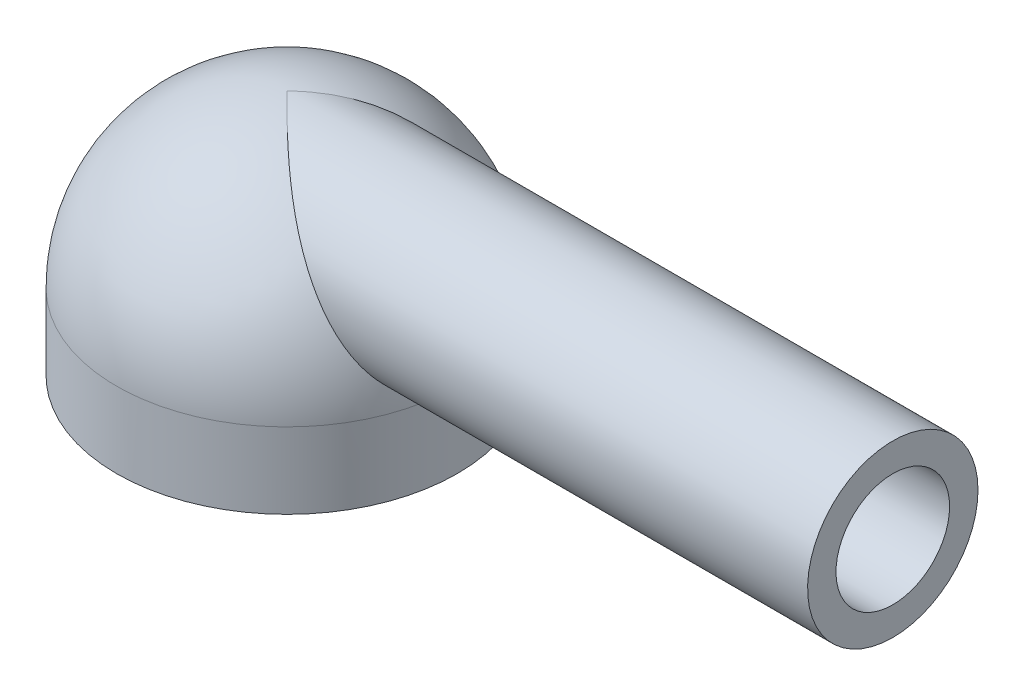
ISO-10303-21;
HEADER;
FILE_DESCRIPTION(('STEP AP214'),'2;1');
FILE_NAME('part.step','',(''),(''),'','','');
FILE_SCHEMA(('AUTOMOTIVE_DESIGN { 1 0 10303 214 1 1 1 1 }'));
ENDSEC;
DATA;
#1=APPLICATION_CONTEXT('core data for automotive mechanical design processes');
#2=APPLICATION_PROTOCOL_DEFINITION('international standard','automotive_design',2000,#1);
#3=PRODUCT_CONTEXT('',#1,'mechanical');
#4=PRODUCT('Part','Part','',(#3));
#5=PRODUCT_RELATED_PRODUCT_CATEGORY('part','',(#4));
#6=PRODUCT_DEFINITION_FORMATION('','',#4);
#7=PRODUCT_DEFINITION_CONTEXT('part definition',#1,'design');
#8=PRODUCT_DEFINITION('design','',#6,#7);
#9=PRODUCT_DEFINITION_SHAPE('','',#8);
#10=(LENGTH_UNIT() NAMED_UNIT(*) SI_UNIT(.MILLI.,.METRE.));
#11=(NAMED_UNIT(*) PLANE_ANGLE_UNIT() SI_UNIT($,.RADIAN.));
#12=(NAMED_UNIT(*) SI_UNIT($,.STERADIAN.) SOLID_ANGLE_UNIT());
#13=UNCERTAINTY_MEASURE_WITH_UNIT(LENGTH_MEASURE(1.E-05),#10,'distance_accuracy_value','');
#14=(GEOMETRIC_REPRESENTATION_CONTEXT(3) GLOBAL_UNCERTAINTY_ASSIGNED_CONTEXT((#13)) GLOBAL_UNIT_ASSIGNED_CONTEXT((#10,
#11,#12)) REPRESENTATION_CONTEXT('',''));
#15=CARTESIAN_POINT('',(0.,0.,0.));
#16=DIRECTION('',(0.,0.,1.));
#17=DIRECTION('',(1.,0.,0.));
#18=AXIS2_PLACEMENT_3D('',#15,#16,#17);
#19=CARTESIAN_POINT('',(0.,1.,0.));
#20=DIRECTION('',(0.,-1.,0.));
#21=DIRECTION('',(0.,0.,1.));
#22=AXIS2_PLACEMENT_3D('',#19,#20,#21);
#23=SPHERICAL_SURFACE('',#22,2.25);
#24=CARTESIAN_POINT('',(0.,3.25,0.));
#25=CARTESIAN_POINT('',(9.05811432640901E-10,3.25,1.96018961577093E-06));
#26=CARTESIAN_POINT('',(1.33427028641567E-07,3.2499999999936,3.92031702239373E-06));
#27=CARTESIAN_POINT('',(6.20651964426027E-07,3.24999999996991,7.81326036176809E-06));
#28=CARTESIAN_POINT('',(9.7564636450451E-07,3.24999999995261,9.74603717467581E-06));
#29=CARTESIAN_POINT('',(2.32527904397885E-06,3.24999999988665,1.55043494262035E-05));
#30=CARTESIAN_POINT('',(3.60356854436376E-06,3.24999999982398,1.9263289765096E-05));
#31=CARTESIAN_POINT('',(6.72941668249995E-06,3.24999999966975,2.66996610941845E-05));
#32=CARTESIAN_POINT('',(8.59752791974171E-06,3.24999999957715,3.03679582621604E-05));
#33=CARTESIAN_POINT('',(1.27272592921817E-05,3.24999999937084,3.74576214970043E-05));
#34=CARTESIAN_POINT('',(1.4987883583727E-05,3.24999999925719,4.08795821893033E-05));
#35=CARTESIAN_POINT('',(2.27908201300751E-05,3.24999999886121,5.17748336515401E-05));
#36=CARTESIAN_POINT('',(2.88549184995158E-05,3.24999999854796,5.88744167160316E-05));
#37=CARTESIAN_POINT('',(4.16969162792588E-05,3.24999999786524,7.21374830147851E-05));
#38=CARTESIAN_POINT('',(4.84621950668114E-05,3.24999999749673,7.83138492218285E-05));
#39=CARTESIAN_POINT('',(7.33235224988269E-05,3.2499999960966,0.000100045656462333));
#40=CARTESIAN_POINT('',(9.21583530649733E-05,3.24999999495096,0.000114724349133618));
#41=CARTESIAN_POINT('',(0.000129465223487893,3.24999999201135,0.000142094647758346));
#42=CARTESIAN_POINT('',(0.000147887228419324,3.24999999026202,0.000154853038861179));
#43=CARTESIAN_POINT('',(0.000259199743905247,3.24999997681058,0.000238884880226714));
#44=CARTESIAN_POINT('',(0.000336415153716784,3.24999995437168,0.000328752215362982));
#45=CARTESIAN_POINT('',(0.000613902739817747,3.24999984529659,0.000632994323338853));
#46=CARTESIAN_POINT('',(0.000825970468211919,3.24999971282642,0.000833192554454458));
#47=CARTESIAN_POINT('',(0.00156163805063496,3.24999904796458,0.00154355811611628));
#48=CARTESIAN_POINT('',(0.00207411316121067,3.24999821374081,0.00206709560574095));
#49=CARTESIAN_POINT('',(0.00395321699217932,3.24999386205143,0.0039718673965563));
#50=CARTESIAN_POINT('',(0.00533091849721474,3.24998818867695,0.00533978277079203));
#51=CARTESIAN_POINT('',(0.0301732512724062,3.24984048810671,0.0300216930954134));
#52=CARTESIAN_POINT('',(0.05352184286538,3.24897086247769,0.0534776793398877));
#53=CARTESIAN_POINT('',(0.0998239687153791,3.24580366264258,0.0997783083600828));
#54=CARTESIAN_POINT('',(0.12277656532948,3.24353357753292,0.122626090570724));
#55=CARTESIAN_POINT('',(0.170095404440222,3.23740604094128,0.169624312342776));
#56=CARTESIAN_POINT('',(0.194459186101241,3.23345722598542,0.193765687040525));
#57=CARTESIAN_POINT('',(0.243277039450825,3.22396210923072,0.241894621719224));
#58=CARTESIAN_POINT('',(0.267730924792469,3.21840763542557,0.26588073639537));
#59=CARTESIAN_POINT('',(0.333601920514515,3.20130078692018,0.330071059930498));
#60=CARTESIAN_POINT('',(0.37497366631697,3.18826515023657,0.369937856240129));
#61=CARTESIAN_POINT('',(0.456938826950228,3.15793971568935,0.447635047779458));
#62=CARTESIAN_POINT('',(0.497535240821788,3.140709290488,0.485485577814262));
#63=CARTESIAN_POINT('',(0.580803562405959,3.10088869079971,0.561435283913795));
#64=CARTESIAN_POINT('',(0.623458652430685,3.07804481395,0.599420562946998));
#65=CARTESIAN_POINT('',(0.70851988946529,3.02769589572361,0.672871247610606));
#66=CARTESIAN_POINT('',(0.750924497618804,3.00017365298055,0.708326642530363));
#67=CARTESIAN_POINT('',(0.836880032171281,2.93957732111965,0.777353211503859));
#68=CARTESIAN_POINT('',(0.880410982538738,2.90632828048585,0.810796575609238));
#69=CARTESIAN_POINT('',(0.96674570345769,2.83545220233582,0.873570066948758));
#70=CARTESIAN_POINT('',(1.00955018100497,2.79782973861746,0.902904421881505));
#71=CARTESIAN_POINT('',(1.13051149311976,2.68470924413531,0.979913587964727));
#72=CARTESIAN_POINT('',(1.20775529417918,2.60422452525122,1.02195313196816));
#73=CARTESIAN_POINT('',(1.35763817857081,2.43327703175708,1.08573337434004));
#74=CARTESIAN_POINT('',(1.43031809884676,2.34293187020593,1.10768916161262));
#75=CARTESIAN_POINT('',(1.55234430805659,2.18019066022006,1.12580512876139));
#76=CARTESIAN_POINT('',(1.60284730034388,2.10922890521001,1.12718484668288));
#77=CARTESIAN_POINT('',(1.70050978959545,1.96584485699836,1.11600502551307));
#78=CARTESIAN_POINT('',(1.74766368789531,1.8934203665487,1.10342270379711));
#79=CARTESIAN_POINT('',(1.83796360191609,1.74953008649378,1.06313933787959));
#80=CARTESIAN_POINT('',(1.88108209405442,1.67807337525351,1.03534223832011));
#81=CARTESIAN_POINT('',(1.96189507652379,1.54004361795748,0.964087054679175));
#82=CARTESIAN_POINT('',(1.99959582203502,1.47346498407589,0.920647237832456));
#83=CARTESIAN_POINT('',(2.06375235395952,1.35747327521119,0.825456803845492));
#84=CARTESIAN_POINT('',(2.09103883775237,1.30695604170453,0.775614695086924));
#85=CARTESIAN_POINT('',(2.13982862383019,1.21521296284135,0.665600100582713));
#86=CARTESIAN_POINT('',(2.16133833179745,1.17397683425307,0.605439179403784));
#87=CARTESIAN_POINT('',(2.19519938630672,1.10837551274702,0.485875736139792));
#88=CARTESIAN_POINT('',(2.20841631518883,1.08244813499091,0.427572297538004));
#89=CARTESIAN_POINT('',(2.22958801136468,1.04068910851535,0.306563131699245));
#90=CARTESIAN_POINT('',(2.23754660627152,1.024850116625,0.243860643449958));
#91=CARTESIAN_POINT('',(2.24743468831599,1.00513725027923,0.122309484891463));
#92=CARTESIAN_POINT('',(2.24986509190567,1.00026968111413,0.0636605517483716));
#93=CARTESIAN_POINT('',(2.25012384470635,0.999752448967473,-0.0536812432773582));
#94=CARTESIAN_POINT('',(2.24795345260052,1.00410026484589,-0.112374088755059));
#95=CARTESIAN_POINT('',(2.2392295454547,1.02149724790953,-0.226059552526846));
#96=CARTESIAN_POINT('',(2.23282683616555,1.03424699150812,-0.281110174927975));
#97=CARTESIAN_POINT('',(2.2159663837537,1.06758387392855,-0.388120255767393));
#98=CARTESIAN_POINT('',(2.20550846960751,1.08817134329655,-0.440079583727378));
#99=CARTESIAN_POINT('',(2.1804949319796,1.13693404100862,-0.540891203125296));
#100=CARTESIAN_POINT('',(2.16584439797177,1.16528426875943,-0.589634928271874));
#101=CARTESIAN_POINT('',(2.13290818909164,1.22821044217023,-0.681540949791084));
#102=CARTESIAN_POINT('',(2.11462163413809,1.26278789490852,-0.724701890695102));
#103=CARTESIAN_POINT('',(2.07331856787636,1.33969186391435,-0.807679610229763));
#104=CARTESIAN_POINT('',(2.05005297203464,1.38240142912751,-0.847016375188481));
#105=CARTESIAN_POINT('',(2.0002250192626,1.47209816991994,-0.917942160916231));
#106=CARTESIAN_POINT('',(1.97366132345519,1.51908708064057,-0.949528019584249));
#107=CARTESIAN_POINT('',(1.91457809647107,1.62126925479918,-1.00782439432713));
#108=CARTESIAN_POINT('',(1.88172480102675,1.67679550709773,-1.03361135364823));
#109=CARTESIAN_POINT('',(1.81303690601438,1.78959025458501,-1.07552323897644));
#110=CARTESIAN_POINT('',(1.77720140497117,1.84685927324261,-1.09164523124148));
#111=CARTESIAN_POINT('',(1.69805779361712,1.96927349668296,-1.1161408890697));
#112=CARTESIAN_POINT('',(1.65439056121297,2.03445021082627,-1.12319396350044));
#113=CARTESIAN_POINT('',(1.564371508806,2.1632321769573,-1.12619770629819));
#114=CARTESIAN_POINT('',(1.51801657173228,2.22683547714306,-1.12213522067329));
#115=CARTESIAN_POINT('',(1.41628409168364,2.35981464298391,-1.10255519822098));
#116=CARTESIAN_POINT('',(1.36056894147832,2.42870162829896,-1.08547134805787));
#117=CARTESIAN_POINT('',(1.24705462495726,2.56025378078396,-1.03972156373415));
#118=CARTESIAN_POINT('',(1.18926117386618,2.62293446152127,-1.01108546558183));
#119=CARTESIAN_POINT('',(1.06421668325056,2.74859803823612,-0.939489714525024));
#120=CARTESIAN_POINT('',(0.996718523000147,2.81054477633036,-0.895145064098794));
#121=CARTESIAN_POINT('',(0.859093961899253,2.92411318490263,-0.795503254234519));
#122=CARTESIAN_POINT('',(0.78894427851278,2.97558262839053,-0.740065060006015));
#123=CARTESIAN_POINT('',(0.677965969308491,3.04643868792741,-0.646826348610847));
#124=CARTESIAN_POINT('',(0.637525857807023,3.07009403154212,-0.611717227600246));
#125=CARTESIAN_POINT('',(0.556254824590361,3.11321434186365,-0.539290474954689));
#126=CARTESIAN_POINT('',(0.515423431414927,3.13267334054035,-0.501969792892079));
#127=CARTESIAN_POINT('',(0.435608786853856,3.16633599504905,-0.427581293261126));
#128=CARTESIAN_POINT('',(0.396637818381272,3.18075753280826,-0.390598165131041));
#129=CARTESIAN_POINT('',(0.318724228913849,3.205521842123,-0.315666999349266));
#130=CARTESIAN_POINT('',(0.279782490063122,3.21588517906847,-0.277724892096529));
#131=CARTESIAN_POINT('',(0.222923202689021,3.22805542501954,-0.22184955745478));
#132=CARTESIAN_POINT('',(0.205043460190169,3.23145639678119,-0.204210800295072));
#133=CARTESIAN_POINT('',(0.169013208388568,3.23745064343145,-0.168551318312389));
#134=CARTESIAN_POINT('',(0.150862474079695,3.24003170775099,-0.150528733594428));
#135=CARTESIAN_POINT('',(0.111152063662967,3.2447148452035,-0.111042972600443));
#136=CARTESIAN_POINT('',(0.0895871946271036,3.24663813263176,-0.0895642610960563));
#137=CARTESIAN_POINT('',(0.0476197553800065,3.24917859010716,-0.047580857989562));
#138=CARTESIAN_POINT('',(0.0272146701362946,3.24985807848282,-0.0270831441996352));
#139=CARTESIAN_POINT('',(0.00533347032050108,3.24998817350003,-0.00534225598084578));
#140=CARTESIAN_POINT('',(0.00395826622833466,3.24999384119597,-0.0039768746547119));
#141=CARTESIAN_POINT('',(0.0020800060472701,3.24999820365381,-0.00207296783718035));
#142=CARTESIAN_POINT('',(0.00156589904999307,3.24999904289415,-0.00154773843605029));
#143=CARTESIAN_POINT('',(0.000827913614110669,3.24999971149246,-0.000835166176924274));
#144=CARTESIAN_POINT('',(0.000615212431637305,3.24999984465491,-0.000634385111542994));
#145=CARTESIAN_POINT('',(0.000336981975193171,3.24999995422359,-0.00032929277820059));
#146=CARTESIAN_POINT('',(0.00025960565877801,3.2499999767482,-0.000239225217301168));
#147=CARTESIAN_POINT('',(0.00014804940548948,3.24999999024117,-0.000155049794049268));
#148=CARTESIAN_POINT('',(0.000129598684508558,3.24999999199459,-0.000142278539871497));
#149=CARTESIAN_POINT('',(9.22348729509783E-05,3.2499999949409,-0.000114874780399028));
#150=CARTESIAN_POINT('',(7.33721434150802E-05,3.24999999608896,-0.000100175020056816));
#151=CARTESIAN_POINT('',(4.84788619246233E-05,3.24999999749196,-7.84114748966533E-05));
#152=CARTESIAN_POINT('',(4.1706834563031E-05,3.24999999786114,-7.22274463632436E-05));
#153=CARTESIAN_POINT('',(2.88532179018688E-05,3.24999999854513,-5.89469620452586E-05));
#154=CARTESIAN_POINT('',(2.27842970472567E-05,3.24999999885898,-5.1837579092599E-05));
#155=CARTESIAN_POINT('',(1.49770124356685E-05,3.24999999925572,-4.09275495933417E-05));
#156=CARTESIAN_POINT('',(1.27155474001509E-05,3.24999999936958,-3.75012426503708E-05));
#157=CARTESIAN_POINT('',(8.58499386477057E-06,3.24999999957628,-3.04025878530365E-05));
#158=CARTESIAN_POINT('',(6.716904930263E-06,3.24999999966906,-2.67296437654157E-05));
#159=CARTESIAN_POINT('',(3.59231351423734E-06,3.24999999982359,-1.92841712109348E-05));
#160=CARTESIAN_POINT('',(2.31519247947946E-06,3.24999999988639,-1.5520791937995E-05));
#161=CARTESIAN_POINT('',(9.68428839193062E-07,3.24999999995249,-9.75602292873E-06));
#162=CARTESIAN_POINT('',(6.14571616704862E-07,3.24999999996983,-7.82114465495061E-06));
#163=CARTESIAN_POINT('',(1.3004990353239E-07,3.24999999999357,-3.92413076441127E-06));
#164=CARTESIAN_POINT('',(-9.06663831045385E-10,3.25,-1.96203421906304E-06));
#165=CARTESIAN_POINT('',(0.,3.25,0.));
#166=B_SPLINE_CURVE_WITH_KNOTS('',3,(#24,#25,#26,#27,#28,#29,#30,#31,#32,#33,#34,#35,#36,#37,
#38,#39,#40,#41,#42,#43,#44,#45,#46,#47,#48,#49,#50,#51,#52,#53,#54,#55,#56,#57,#58,#59,#60,#61,
#62,#63,#64,#65,#66,#67,#68,#69,#70,#71,#72,#73,#74,#75,#76,#77,#78,#79,#80,#81,#82,#83,#84,#85,
#86,#87,#88,#89,#90,#91,#92,#93,#94,#95,#96,#97,#98,#99,#100,#101,#102,#103,#104,#105,#106,#107,
#108,#109,#110,#111,#112,#113,#114,#115,#116,#117,#118,#119,#120,#121,#122,#123,#124,#125,#126,
#127,#128,#129,#130,#131,#132,#133,#134,#135,#136,#137,#138,#139,#140,#141,#142,#143,#144,#145,
#146,#147,#148,#149,#150,#151,#152,#153,#154,#155,#156,#157,#158,#159,#160,#161,#162,#163,#164,
#165),.UNSPECIFIED.,.T.,.F.,(4,2,2,2,2,2,2,2,2,2,2,2,2,2,2,2,2,2,2,2,2,2,2,2,2,2,2,2,2,2,2,2,2,
2,2,2,2,2,2,2,2,2,2,2,2,2,2,2,2,2,2,2,2,2,2,2,2,2,2,2,2,2,2,2,2,2,2,2,2,2,4),(0.,
5.87761071530498E-06,1.17629171222564E-05,2.36117953532573E-05,3.59302462593564E-05,
4.82178889380213E-05,7.61098222800456E-05,0.000103566345960557,0.000175142280254572,
0.000242275906597203,0.00059425153305472,0.00147110809326697,0.00366667219104872,
0.00949294457824866,0.108755005513167,0.206128088503062,0.309663326981115,0.413735076252703,
0.590276798983938,0.764451856992498,0.948770579579438,1.13378227262883,1.32602523491424,
1.51806892511015,1.8735358749507,2.22514975925124,2.48542002760376,2.7461156185446,
3.00847636560207,3.27053172163729,3.49727686151554,3.72376952299128,3.91818786534438,
4.11246453155859,4.28828588078694,4.46405913511484,4.63388439884082,4.80371682552581,
4.9777477828455,5.15182091490534,5.33870730563682,5.52566981325189,5.73327843154672,
5.9409500363108,6.17632614425455,6.41198091328762,6.68159347036843,6.95051411164896,
7.25466477352907,7.5629607062793,7.73843243333976,7.91415209362532,8.08088465365545,
8.24676099126412,8.32278533562362,8.39989389067913,8.49136599609937,8.57811454497164,
8.58393015086909,8.58613274993638,8.58701220112291,8.58736493022842,8.58743215632875,
8.58750383655358,8.58753132343094,8.58755924669539,8.58757154656524,8.58758387732156,
8.58759573751786,8.58760162838463,8.58760751152637),.UNSPECIFIED.);
#167=CARTESIAN_POINT('',(0.,3.25,0.));
#168=VERTEX_POINT('',#167);
#169=CARTESIAN_POINT('',(2.25,1.,0.));
#170=VERTEX_POINT('',#169);
#171=EDGE_CURVE('E11',#168,#170,#166,.T.);
#172=ORIENTED_EDGE('',*,*,#171,.F.);
#173=EDGE_CURVE('E51',#170,#168,#166,.T.);
#174=ORIENTED_EDGE('',*,*,#173,.F.);
#175=CARTESIAN_POINT('',(0.,1.,0.));
#176=DIRECTION('',(0.,1.,0.));
#177=DIRECTION('',(0.,0.,1.));
#178=AXIS2_PLACEMENT_3D('',#175,#176,#177);
#179=CIRCLE('',#178,2.25);
#180=EDGE_CURVE('E59',#170,#170,#179,.T.);
#181=ORIENTED_EDGE('',*,*,#180,.T.);
#182=EDGE_LOOP('',(#172,#174,#181));
#183=FACE_BOUND('',#182,.T.);
#184=ADVANCED_FACE('F37',(#183),#23,.T.);
#185=CARTESIAN_POINT('',(0.,0.,0.));
#186=DIRECTION('',(0.,1.,0.));
#187=DIRECTION('',(0.,0.,1.));
#188=AXIS2_PLACEMENT_3D('',#185,#186,#187);
#189=PLANE('',#188);
#190=CARTESIAN_POINT('',(0.,0.,0.));
#191=DIRECTION('',(0.,1.,0.));
#192=DIRECTION('',(0.,0.,1.));
#193=AXIS2_PLACEMENT_3D('',#190,#191,#192);
#194=CIRCLE('',#193,2.25);
#195=CARTESIAN_POINT('',(0.,0.,2.25));
#196=VERTEX_POINT('',#195);
#197=EDGE_CURVE('E62',#196,#196,#194,.T.);
#198=ORIENTED_EDGE('',*,*,#197,.F.);
#199=EDGE_LOOP('',(#198));
#200=FACE_BOUND('',#199,.T.);
#201=CARTESIAN_POINT('',(0.,0.,0.));
#202=DIRECTION('',(0.,1.,0.));
#203=DIRECTION('',(0.,0.,1.));
#204=AXIS2_PLACEMENT_3D('',#201,#202,#203);
#205=CIRCLE('',#204,1.75);
#206=CARTESIAN_POINT('',(0.,0.,1.75));
#207=VERTEX_POINT('',#206);
#208=EDGE_CURVE('E109',#207,#207,#205,.T.);
#209=ORIENTED_EDGE('',*,*,#208,.T.);
#210=EDGE_LOOP('',(#209));
#211=FACE_BOUND('',#210,.T.);
#212=ADVANCED_FACE('F93',(#200,#211),#189,.F.);
#213=CARTESIAN_POINT('',(0.,1.,0.));
#214=DIRECTION('',(0.,-1.,0.));
#215=DIRECTION('',(0.,0.,-1.));
#216=AXIS2_PLACEMENT_3D('',#213,#214,#215);
#217=CYLINDRICAL_SURFACE('',#216,2.25);
#218=ORIENTED_EDGE('',*,*,#180,.F.);
#219=EDGE_LOOP('',(#218));
#220=FACE_BOUND('',#219,.T.);
#221=ORIENTED_EDGE('',*,*,#197,.T.);
#222=EDGE_LOOP('',(#221));
#223=FACE_BOUND('',#222,.T.);
#224=ADVANCED_FACE('F39',(#220,#223),#217,.T.);
#225=CARTESIAN_POINT('',(0.,1.,0.));
#226=DIRECTION('',(0.,-1.,0.));
#227=DIRECTION('',(0.,0.,-1.));
#228=AXIS2_PLACEMENT_3D('',#225,#226,#227);
#229=CYLINDRICAL_SURFACE('',#228,1.75);
#230=CARTESIAN_POINT('',(0.,1.,0.));
#231=DIRECTION('',(0.,-1.,0.));
#232=DIRECTION('',(0.,0.,-1.));
#233=AXIS2_PLACEMENT_3D('',#230,#231,#232);
#234=CIRCLE('',#233,1.75);
#235=CARTESIAN_POINT('',(0.,1.,-1.75));
#236=VERTEX_POINT('',#235);
#237=EDGE_CURVE('E107',#236,#236,#234,.T.);
#238=ORIENTED_EDGE('',*,*,#237,.F.);
#239=EDGE_LOOP('',(#238));
#240=FACE_BOUND('',#239,.T.);
#241=ORIENTED_EDGE('',*,*,#208,.F.);
#242=EDGE_LOOP('',(#241));
#243=FACE_BOUND('',#242,.T.);
#244=ADVANCED_FACE('F85',(#240,#243),#229,.F.);
#245=CARTESIAN_POINT('',(0.,1.,0.));
#246=DIRECTION('',(0.,-1.,0.));
#247=DIRECTION('',(0.,0.,-1.));
#248=AXIS2_PLACEMENT_3D('',#245,#246,#247);
#249=PLANE('',#248);
#250=ORIENTED_EDGE('',*,*,#237,.T.);
#251=EDGE_LOOP('',(#250));
#252=FACE_BOUND('',#251,.T.);
#253=ADVANCED_FACE('F82',(#252),#249,.T.);
#254=CARTESIAN_POINT('',(8.,2.125,0.));
#255=DIRECTION('',(-1.,0.,0.));
#256=DIRECTION('',(0.,0.,1.));
#257=AXIS2_PLACEMENT_3D('',#254,#255,#256);
#258=CYLINDRICAL_SURFACE('',#257,0.75);
#259=CARTESIAN_POINT('',(8.,2.125,0.));
#260=DIRECTION('',(1.,0.,0.));
#261=DIRECTION('',(0.,0.,-1.));
#262=AXIS2_PLACEMENT_3D('',#259,#260,#261);
#263=CIRCLE('',#262,0.75);
#264=CARTESIAN_POINT('',(8.,2.125,-0.75));
#265=VERTEX_POINT('',#264);
#266=EDGE_CURVE('E112',#265,#265,#263,.T.);
#267=ORIENTED_EDGE('',*,*,#266,.T.);
#268=EDGE_LOOP('',(#267));
#269=FACE_BOUND('',#268,.T.);
#270=CARTESIAN_POINT('',(1.26532607486081,2.8509221885677,-0.188512535777142));
#271=CARTESIAN_POINT('',(1.25825723608229,2.85887312356831,-0.157897443188149));
#272=CARTESIAN_POINT('',(1.25277996759959,2.86496891558252,-0.126430821422814));
#273=CARTESIAN_POINT('',(1.24547763902908,2.87307751333391,-0.0625607871328923));
#274=CARTESIAN_POINT('',(1.24365026038285,2.87509291111454,-0.0301579825912281));
#275=CARTESIAN_POINT('',(1.24382443145352,2.87490034609621,0.0346557535852534));
#276=CARTESIAN_POINT('',(1.24582981874454,2.87268815040053,0.0670666608434229));
#277=CARTESIAN_POINT('',(1.25347981759332,2.86418992541018,0.130907046325965));
#278=CARTESIAN_POINT('',(1.25912600221166,2.85790213518823,0.162336094166368));
#279=CARTESIAN_POINT('',(1.27351931082085,2.84169958358373,0.223221805239369));
#280=CARTESIAN_POINT('',(1.28224373243982,2.8318113592085,0.25269107993317));
#281=CARTESIAN_POINT('',(1.30221611355968,2.80887026411118,0.309451806356993));
#282=CARTESIAN_POINT('',(1.31346562383302,2.79581544824143,0.336741905732645));
#283=CARTESIAN_POINT('',(1.34356850613416,2.76033999854821,0.400920675794686));
#284=CARTESIAN_POINT('',(1.3635369732559,2.73637568985615,0.436437223291437));
#285=CARTESIAN_POINT('',(1.4062241682236,2.68382947142835,0.501976277050063));
#286=CARTESIAN_POINT('',(1.42894735822996,2.65524004408413,0.531989666190353));
#287=CARTESIAN_POINT('',(1.47645658092366,2.59389952999154,0.586813475327914));
#288=CARTESIAN_POINT('',(1.50126924894753,2.56109051532829,0.611535493376877));
#289=CARTESIAN_POINT('',(1.55184129647158,2.49246859653005,0.655071294009564));
#290=CARTESIAN_POINT('',(1.57760048730508,2.45665628922431,0.673886246965832));
#291=CARTESIAN_POINT('',(1.63452860482885,2.37551068346251,0.708554390356614));
#292=CARTESIAN_POINT('',(1.66577683930428,2.32967882052198,0.723123295396));
#293=CARTESIAN_POINT('',(1.72798294278146,2.23585330047985,0.743314389214091));
#294=CARTESIAN_POINT('',(1.75894057972704,2.1878580682866,0.748929947468254));
#295=CARTESIAN_POINT('',(1.82115677024983,2.08889852302819,0.750832840000611));
#296=CARTESIAN_POINT('',(1.85236978210912,2.03789590016396,0.746703557168518));
#297=CARTESIAN_POINT('',(1.91285042180968,1.93668561448251,0.727794547163052));
#298=CARTESIAN_POINT('',(1.94211859918907,1.88647773018255,0.713017842653707));
#299=CARTESIAN_POINT('',(1.9959358128125,1.7922402357949,0.673939110911289));
#300=CARTESIAN_POINT('',(2.02067030388217,1.74802256857601,0.650351414602814));
#301=CARTESIAN_POINT('',(2.06687708363151,1.66407884495373,0.593805316775767));
#302=CARTESIAN_POINT('',(2.08835255446503,1.62434841697027,0.560856147429729));
#303=CARTESIAN_POINT('',(2.12466086720306,1.55632354961439,0.491086096585746));
#304=CARTESIAN_POINT('',(2.13999395222787,1.52721425728858,0.455321145964521));
#305=CARTESIAN_POINT('',(2.16695362723417,1.47560853460527,0.378074933726718));
#306=CARTESIAN_POINT('',(2.17858419363969,1.45310501183377,0.336599873711526));
#307=CARTESIAN_POINT('',(2.19637641604163,1.41849968846584,0.255062163502593));
#308=CARTESIAN_POINT('',(2.20305445899397,1.40542227908665,0.215524494539788));
#309=CARTESIAN_POINT('',(2.21296581676083,1.38596992907908,0.134423092785792));
#310=CARTESIAN_POINT('',(2.21620128057086,1.37959080714464,0.0928606409129582));
#311=CARTESIAN_POINT('',(2.21897558353374,1.37412169403317,0.0126656258597162));
#312=CARTESIAN_POINT('',(2.21880227708488,1.37446409694522,-0.0259195680759224));
#313=CARTESIAN_POINT('',(2.21546623974053,1.38103873129771,-0.102447888583316));
#314=CARTESIAN_POINT('',(2.21230404787428,1.38726990073108,-0.140391129671871));
#315=CARTESIAN_POINT('',(2.2031845262335,1.40516580366797,-0.213878209074498));
#316=CARTESIAN_POINT('',(2.19727849947653,1.41673078027753,-0.249452930938871));
#317=CARTESIAN_POINT('',(2.18287786670944,1.44476482210833,-0.318046441725241));
#318=CARTESIAN_POINT('',(2.174382932713,1.4612345086968,-0.351064906132251));
#319=CARTESIAN_POINT('',(2.15462071745498,1.49926050266094,-0.415211442322106));
#320=CARTESIAN_POINT('',(2.14324828056674,1.52100805074836,-0.446193314744812));
#321=CARTESIAN_POINT('',(2.11825229508667,1.56835035925621,-0.50402302930261));
#322=CARTESIAN_POINT('',(2.10462803589318,1.59394633388348,-0.530869561275985));
#323=CARTESIAN_POINT('',(2.07411375835607,1.65063559872357,-0.582299568570492));
#324=CARTESIAN_POINT('',(2.05703942712947,1.68201713237159,-0.60645523198572));
#325=CARTESIAN_POINT('',(2.02098056640519,1.74737240829867,-0.649171494277774));
#326=CARTESIAN_POINT('',(2.0019952128263,1.78134726734585,-0.66772966546906));
#327=CARTESIAN_POINT('',(1.96013448677736,1.85510463269224,-0.70105779579727));
#328=CARTESIAN_POINT('',(1.93706484627755,1.8950978866612,-0.715116888192199));
#329=CARTESIAN_POINT('',(1.88946980882616,1.97604267646567,-0.736249891450262));
#330=CARTESIAN_POINT('',(1.86494376989208,2.01699463000639,-0.743320697270538));
#331=CARTESIAN_POINT('',(1.81183098661158,2.10385788133694,-0.751117544993253));
#332=CARTESIAN_POINT('',(1.78311268547005,2.14976782930536,-0.750969340162576));
#333=CARTESIAN_POINT('',(1.72498780533849,2.24039460352303,-0.742467801331496));
#334=CARTESIAN_POINT('',(1.69558076995559,2.28511059404211,-0.734108867141674));
#335=CARTESIAN_POINT('',(1.63408320386263,2.37618817176551,-0.708406213678726));
#336=CARTESIAN_POINT('',(1.60198750246917,2.42234022391282,-0.690326929952813));
#337=CARTESIAN_POINT('',(1.53869001662619,2.51069193722562,-0.64513818321432));
#338=CARTESIAN_POINT('',(1.50748805160598,2.55289240073675,-0.618030558466351));
#339=CARTESIAN_POINT('',(1.45254783423685,2.62504409080988,-0.560532740311725));
#340=CARTESIAN_POINT('',(1.42845836846101,2.65584699896462,-0.531544859873703));
#341=CARTESIAN_POINT('',(1.38279904060516,2.71289339778985,-0.467664794089095));
#342=CARTESIAN_POINT('',(1.36122656807843,2.73914162627182,-0.432778819496998));
#343=CARTESIAN_POINT('',(1.32556116068067,2.78167686509992,-0.364142625544485));
#344=CARTESIAN_POINT('',(1.31082082753166,2.79890639851431,-0.331317086496686));
#345=CARTESIAN_POINT('',(1.2850368340293,2.8286542683101,-0.262253995818211));
#346=CARTESIAN_POINT('',(1.27398687355137,2.84118063842068,-0.226022395899026));
#347=CARTESIAN_POINT('',(1.26532607486081,2.8509221885677,-0.188512535777142));
#348=B_SPLINE_CURVE_WITH_KNOTS('',3,(#270,#271,#272,#273,#274,#275,#276,#277,#278,#279,#280,
#281,#282,#283,#284,#285,#286,#287,#288,#289,#290,#291,#292,#293,#294,#295,#296,#297,#298,#299,
#300,#301,#302,#303,#304,#305,#306,#307,#308,#309,#310,#311,#312,#313,#314,#315,#316,#317,#318,
#319,#320,#321,#322,#323,#324,#325,#326,#327,#328,#329,#330,#331,#332,#333,#334,#335,#336,#337,
#338,#339,#340,#341,#342,#343,#344,#345,#346,#347),.UNSPECIFIED.,.T.,.F.,(4,2,2,2,2,2,2,2,2,2,2,
2,2,2,2,2,2,2,2,2,2,2,2,2,2,2,2,2,2,2,2,2,2,2,2,2,2,2,4),(0.,0.0971140431030788,
0.194166375771923,0.291315933434493,0.388507494157635,0.484996743531939,0.581545414296081,
0.72258654854044,0.863859276033576,1.00733428338472,1.15078084592746,1.32207817579093,
1.49350230343182,1.67238710577615,1.8512211450578,2.01792111783385,2.18445726035147,
2.32940042568755,2.47418739592495,2.60003404341102,2.72580208621702,2.84099893749724,
2.95617501761425,3.06927927507137,3.18239786756532,3.30047238397411,3.41858423223885,
3.54743694835372,3.67634546902148,3.82055113732335,3.96482085047296,4.12660102578026,
4.28849162114027,4.4648364835165,4.64114546216356,4.78663224043178,4.9319667630556,
5.05115620788009,5.17014112233293),.UNSPECIFIED.);
#349=CARTESIAN_POINT('',(1.26532607486081,2.8509221885677,-0.188512535777142));
#350=VERTEX_POINT('',#349);
#351=EDGE_CURVE('E41',#350,#350,#348,.T.);
#352=ORIENTED_EDGE('',*,*,#351,.F.);
#353=EDGE_LOOP('',(#352));
#354=FACE_BOUND('',#353,.T.);
#355=ADVANCED_FACE('F78',(#269,#354),#258,.F.);
#356=CARTESIAN_POINT('',(8.,2.125,0.));
#357=DIRECTION('',(-1.,0.,0.));
#358=DIRECTION('',(0.,0.,1.));
#359=AXIS2_PLACEMENT_3D('',#356,#357,#358);
#360=CYLINDRICAL_SURFACE('',#359,1.125);
#361=CARTESIAN_POINT('',(8.,2.125,0.));
#362=DIRECTION('',(1.,0.,0.));
#363=DIRECTION('',(0.,0.,-1.));
#364=AXIS2_PLACEMENT_3D('',#361,#362,#363);
#365=CIRCLE('',#364,1.125);
#366=CARTESIAN_POINT('',(8.,2.125,-1.125));
#367=VERTEX_POINT('',#366);
#368=EDGE_CURVE('E108',#367,#367,#365,.T.);
#369=ORIENTED_EDGE('',*,*,#368,.F.);
#370=EDGE_LOOP('',(#369));
#371=FACE_BOUND('',#370,.T.);
#372=ORIENTED_EDGE('',*,*,#173,.T.);
#373=ORIENTED_EDGE('',*,*,#171,.T.);
#374=EDGE_LOOP('',(#372,#373));
#375=FACE_BOUND('',#374,.T.);
#376=ADVANCED_FACE('F61',(#371,#375),#360,.T.);
#377=CARTESIAN_POINT('',(8.,0.,0.));
#378=DIRECTION('',(1.,0.,0.));
#379=DIRECTION('',(0.,0.,-1.));
#380=AXIS2_PLACEMENT_3D('',#377,#378,#379);
#381=PLANE('',#380);
#382=ORIENTED_EDGE('',*,*,#266,.F.);
#383=EDGE_LOOP('',(#382));
#384=FACE_BOUND('',#383,.T.);
#385=ORIENTED_EDGE('',*,*,#368,.T.);
#386=EDGE_LOOP('',(#385));
#387=FACE_BOUND('',#386,.T.);
#388=ADVANCED_FACE('F77',(#384,#387),#381,.T.);
#389=ORIENTED_EDGE('',*,*,#351,.T.);
#390=EDGE_LOOP('',(#389));
#391=FACE_BOUND('',#390,.T.);
#392=ADVANCED_FACE('F70',(#391),#23,.T.);
#393=CLOSED_SHELL('',(#184,#212,#224,#244,#253,#355,#376,#388,#392));
#394=MANIFOLD_SOLID_BREP('B2',#393);
#395=ADVANCED_BREP_SHAPE_REPRESENTATION('',(#18,#394),#14);
#396=SHAPE_DEFINITION_REPRESENTATION(#9,#395);
ENDSEC;
END-ISO-10303-21;
